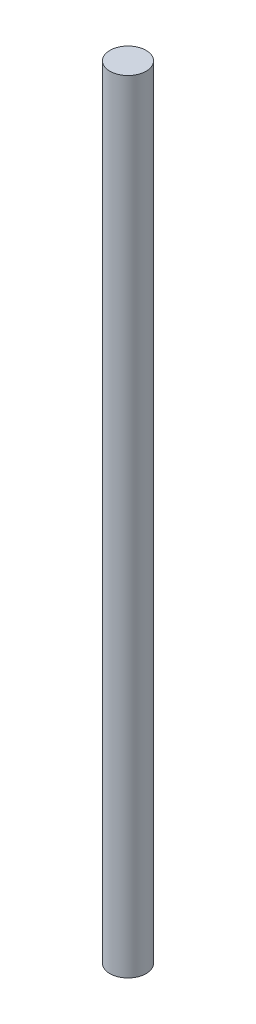
ISO-10303-21;
HEADER;
FILE_DESCRIPTION(('STEP AP214'),'2;1');
FILE_NAME('part.step','',(''),(''),'','','');
FILE_SCHEMA(('AUTOMOTIVE_DESIGN { 1 0 10303 214 1 1 1 1 }'));
ENDSEC;
DATA;
#1=APPLICATION_CONTEXT('core data for automotive mechanical design processes');
#2=APPLICATION_PROTOCOL_DEFINITION('international standard','automotive_design',2000,#1);
#3=PRODUCT_CONTEXT('',#1,'mechanical');
#4=PRODUCT('Part','Part','',(#3));
#5=PRODUCT_RELATED_PRODUCT_CATEGORY('part','',(#4));
#6=PRODUCT_DEFINITION_FORMATION('','',#4);
#7=PRODUCT_DEFINITION_CONTEXT('part definition',#1,'design');
#8=PRODUCT_DEFINITION('design','',#6,#7);
#9=PRODUCT_DEFINITION_SHAPE('','',#8);
#10=(LENGTH_UNIT() NAMED_UNIT(*) SI_UNIT(.MILLI.,.METRE.));
#11=(NAMED_UNIT(*) PLANE_ANGLE_UNIT() SI_UNIT($,.RADIAN.));
#12=(NAMED_UNIT(*) SI_UNIT($,.STERADIAN.) SOLID_ANGLE_UNIT());
#13=UNCERTAINTY_MEASURE_WITH_UNIT(LENGTH_MEASURE(1.E-05),#10,'distance_accuracy_value','');
#14=(GEOMETRIC_REPRESENTATION_CONTEXT(3) GLOBAL_UNCERTAINTY_ASSIGNED_CONTEXT((#13)) GLOBAL_UNIT_ASSIGNED_CONTEXT((#10,
#11,#12)) REPRESENTATION_CONTEXT('',''));
#15=CARTESIAN_POINT('',(0.,0.,0.));
#16=DIRECTION('',(0.,0.,1.));
#17=DIRECTION('',(1.,0.,0.));
#18=AXIS2_PLACEMENT_3D('',#15,#16,#17);
#19=CARTESIAN_POINT('',(0.,685.8,0.));
#20=DIRECTION('',(0.,1.,0.));
#21=DIRECTION('',(0.,0.,1.));
#22=AXIS2_PLACEMENT_3D('',#19,#20,#21);
#23=PLANE('',#22);
#24=CARTESIAN_POINT('',(0.,685.8,0.));
#25=DIRECTION('',(0.,1.,0.));
#26=DIRECTION('',(0.,0.,1.));
#27=AXIS2_PLACEMENT_3D('',#24,#25,#26);
#28=CIRCLE('',#27,31.75);
#29=CARTESIAN_POINT('',(0.,685.8,31.75));
#30=VERTEX_POINT('',#29);
#31=EDGE_CURVE('E15',#30,#30,#28,.F.);
#32=ORIENTED_EDGE('',*,*,#31,.F.);
#33=EDGE_LOOP('',(#32));
#34=FACE_BOUND('',#33,.T.);
#35=ADVANCED_FACE('F12',(#34),#23,.T.);
#36=CARTESIAN_POINT('',(0.,-685.8,0.));
#37=DIRECTION('',(0.,1.,0.));
#38=DIRECTION('',(0.,0.,1.));
#39=AXIS2_PLACEMENT_3D('',#36,#37,#38);
#40=PLANE('',#39);
#41=CARTESIAN_POINT('',(0.,-685.8,0.));
#42=DIRECTION('',(0.,1.,0.));
#43=DIRECTION('',(0.,0.,1.));
#44=AXIS2_PLACEMENT_3D('',#41,#42,#43);
#45=CIRCLE('',#44,31.75);
#46=CARTESIAN_POINT('',(0.,-685.8,31.75));
#47=VERTEX_POINT('',#46);
#48=EDGE_CURVE('E8',#47,#47,#45,.T.);
#49=ORIENTED_EDGE('',*,*,#48,.F.);
#50=EDGE_LOOP('',(#49));
#51=FACE_BOUND('',#50,.T.);
#52=ADVANCED_FACE('F27',(#51),#40,.F.);
#53=CARTESIAN_POINT('',(0.,-685.8,0.));
#54=DIRECTION('',(0.,1.,0.));
#55=DIRECTION('',(0.,0.,1.));
#56=AXIS2_PLACEMENT_3D('',#53,#54,#55);
#57=CYLINDRICAL_SURFACE('',#56,31.75);
#58=ORIENTED_EDGE('',*,*,#31,.T.);
#59=EDGE_LOOP('',(#58));
#60=FACE_BOUND('',#59,.T.);
#61=ORIENTED_EDGE('',*,*,#48,.T.);
#62=EDGE_LOOP('',(#61));
#63=FACE_BOUND('',#62,.T.);
#64=ADVANCED_FACE('F24',(#60,#63),#57,.T.);
#65=CLOSED_SHELL('',(#35,#52,#64));
#66=MANIFOLD_SOLID_BREP('B1',#65);
#67=ADVANCED_BREP_SHAPE_REPRESENTATION('',(#18,#66),#14);
#68=SHAPE_DEFINITION_REPRESENTATION(#9,#67);
ENDSEC;
END-ISO-10303-21;
